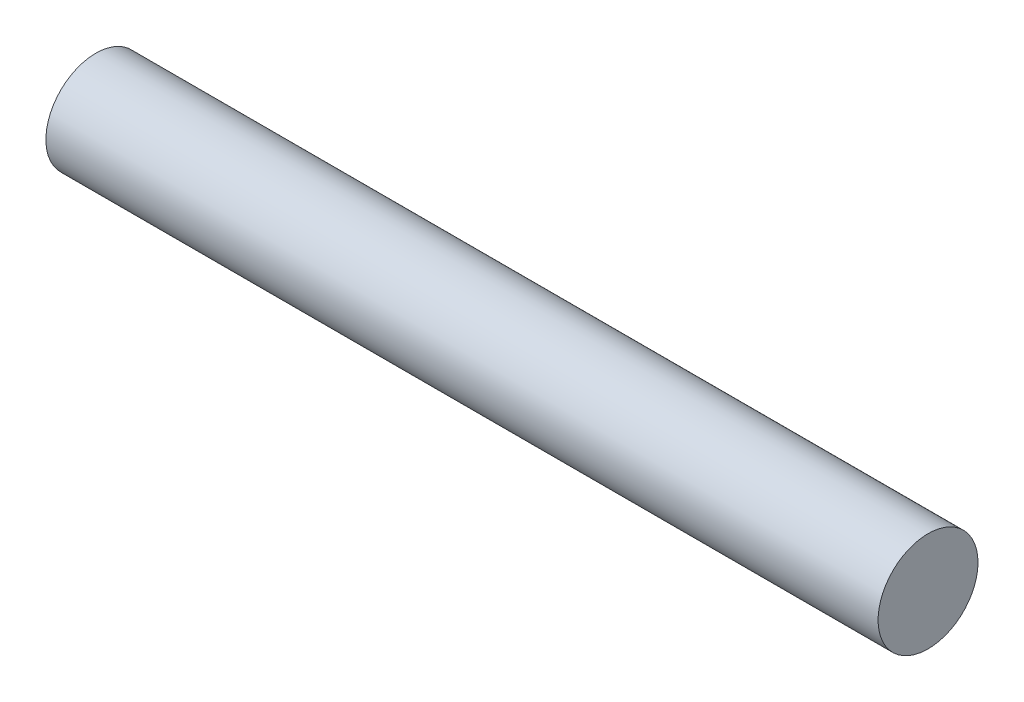
ISO-10303-21;
HEADER;
FILE_DESCRIPTION(('STEP AP214'),'2;1');
FILE_NAME('part.step','',(''),(''),'','','');
FILE_SCHEMA(('AUTOMOTIVE_DESIGN { 1 0 10303 214 1 1 1 1 }'));
ENDSEC;
DATA;
#1=APPLICATION_CONTEXT('core data for automotive mechanical design processes');
#2=APPLICATION_PROTOCOL_DEFINITION('international standard','automotive_design',2000,#1);
#3=PRODUCT_CONTEXT('',#1,'mechanical');
#4=PRODUCT('Part','Part','',(#3));
#5=PRODUCT_RELATED_PRODUCT_CATEGORY('part','',(#4));
#6=PRODUCT_DEFINITION_FORMATION('','',#4);
#7=PRODUCT_DEFINITION_CONTEXT('part definition',#1,'design');
#8=PRODUCT_DEFINITION('design','',#6,#7);
#9=PRODUCT_DEFINITION_SHAPE('','',#8);
#10=(LENGTH_UNIT() NAMED_UNIT(*) SI_UNIT(.MILLI.,.METRE.));
#11=(NAMED_UNIT(*) PLANE_ANGLE_UNIT() SI_UNIT($,.RADIAN.));
#12=(NAMED_UNIT(*) SI_UNIT($,.STERADIAN.) SOLID_ANGLE_UNIT());
#13=UNCERTAINTY_MEASURE_WITH_UNIT(LENGTH_MEASURE(1.E-05),#10,'distance_accuracy_value','');
#14=(GEOMETRIC_REPRESENTATION_CONTEXT(3) GLOBAL_UNCERTAINTY_ASSIGNED_CONTEXT((#13)) GLOBAL_UNIT_ASSIGNED_CONTEXT((#10,
#11,#12)) REPRESENTATION_CONTEXT('',''));
#15=CARTESIAN_POINT('',(0.,0.,0.));
#16=DIRECTION('',(0.,0.,1.));
#17=DIRECTION('',(1.,0.,0.));
#18=AXIS2_PLACEMENT_3D('',#15,#16,#17);
#19=CARTESIAN_POINT('',(39.6748,0.,0.));
#20=DIRECTION('',(-1.,0.,0.));
#21=DIRECTION('',(0.,0.,1.));
#22=AXIS2_PLACEMENT_3D('',#19,#20,#21);
#23=CYLINDRICAL_SURFACE('',#22,2.38125);
#24=CARTESIAN_POINT('',(39.6748,0.,0.));
#25=DIRECTION('',(1.,0.,0.));
#26=DIRECTION('',(0.,0.,-1.));
#27=AXIS2_PLACEMENT_3D('',#24,#25,#26);
#28=CIRCLE('',#27,2.38125);
#29=CARTESIAN_POINT('',(39.6748,0.,-2.38125));
#30=VERTEX_POINT('',#29);
#31=EDGE_CURVE('E10',#30,#30,#28,.T.);
#32=ORIENTED_EDGE('',*,*,#31,.F.);
#33=EDGE_LOOP('',(#32));
#34=FACE_BOUND('',#33,.T.);
#35=CARTESIAN_POINT('',(0.,0.,0.));
#36=DIRECTION('',(1.,0.,0.));
#37=DIRECTION('',(0.,0.,-1.));
#38=AXIS2_PLACEMENT_3D('',#35,#36,#37);
#39=CIRCLE('',#38,2.38125);
#40=CARTESIAN_POINT('',(0.,0.,-2.38125));
#41=VERTEX_POINT('',#40);
#42=EDGE_CURVE('E34',#41,#41,#39,.T.);
#43=ORIENTED_EDGE('',*,*,#42,.T.);
#44=EDGE_LOOP('',(#43));
#45=FACE_BOUND('',#44,.T.);
#46=ADVANCED_FACE('F31',(#34,#45),#23,.T.);
#47=CARTESIAN_POINT('',(39.6748,0.,0.));
#48=DIRECTION('',(1.,0.,0.));
#49=DIRECTION('',(0.,0.,-1.));
#50=AXIS2_PLACEMENT_3D('',#47,#48,#49);
#51=PLANE('',#50);
#52=ORIENTED_EDGE('',*,*,#31,.T.);
#53=EDGE_LOOP('',(#52));
#54=FACE_BOUND('',#53,.T.);
#55=ADVANCED_FACE('F46',(#54),#51,.T.);
#56=CARTESIAN_POINT('',(0.,0.,0.));
#57=DIRECTION('',(1.,0.,0.));
#58=DIRECTION('',(0.,0.,-1.));
#59=AXIS2_PLACEMENT_3D('',#56,#57,#58);
#60=PLANE('',#59);
#61=ORIENTED_EDGE('',*,*,#42,.F.);
#62=EDGE_LOOP('',(#61));
#63=FACE_BOUND('',#62,.T.);
#64=ADVANCED_FACE('F44',(#63),#60,.F.);
#65=CLOSED_SHELL('',(#46,#55,#64));
#66=MANIFOLD_SOLID_BREP('B2',#65);
#67=ADVANCED_BREP_SHAPE_REPRESENTATION('',(#18,#66),#14);
#68=SHAPE_DEFINITION_REPRESENTATION(#9,#67);
ENDSEC;
END-ISO-10303-21;
